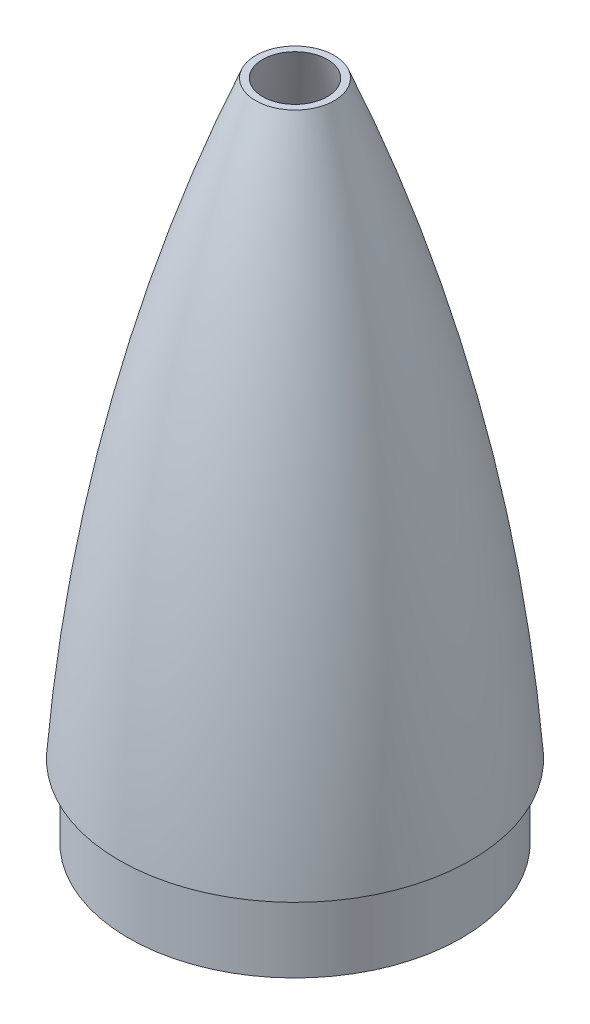
ISO-10303-21;
HEADER;
FILE_DESCRIPTION(('STEP AP214'),'2;1');
FILE_NAME('part.step','',(''),(''),'','','');
FILE_SCHEMA(('AUTOMOTIVE_DESIGN { 1 0 10303 214 1 1 1 1 }'));
ENDSEC;
DATA;
#1=APPLICATION_CONTEXT('core data for automotive mechanical design processes');
#2=APPLICATION_PROTOCOL_DEFINITION('international standard','automotive_design',2000,#1);
#3=PRODUCT_CONTEXT('',#1,'mechanical');
#4=PRODUCT('Part','Part','',(#3));
#5=PRODUCT_RELATED_PRODUCT_CATEGORY('part','',(#4));
#6=PRODUCT_DEFINITION_FORMATION('','',#4);
#7=PRODUCT_DEFINITION_CONTEXT('part definition',#1,'design');
#8=PRODUCT_DEFINITION('design','',#6,#7);
#9=PRODUCT_DEFINITION_SHAPE('','',#8);
#10=(LENGTH_UNIT() NAMED_UNIT(*) SI_UNIT(.MILLI.,.METRE.));
#11=(NAMED_UNIT(*) PLANE_ANGLE_UNIT() SI_UNIT($,.RADIAN.));
#12=(NAMED_UNIT(*) SI_UNIT($,.STERADIAN.) SOLID_ANGLE_UNIT());
#13=UNCERTAINTY_MEASURE_WITH_UNIT(LENGTH_MEASURE(1.E-05),#10,'distance_accuracy_value','');
#14=(GEOMETRIC_REPRESENTATION_CONTEXT(3) GLOBAL_UNCERTAINTY_ASSIGNED_CONTEXT((#13)) GLOBAL_UNIT_ASSIGNED_CONTEXT((#10,
#11,#12)) REPRESENTATION_CONTEXT('',''));
#15=CARTESIAN_POINT('',(0.,0.,0.));
#16=DIRECTION('',(0.,0.,1.));
#17=DIRECTION('',(1.,0.,0.));
#18=AXIS2_PLACEMENT_3D('',#15,#16,#17);
#19=CARTESIAN_POINT('',(-7.7715611723761E-13,-78.5092148022549,0.));
#20=DIRECTION('',(0.,1.,0.));
#21=DIRECTION('',(-1.,0.,0.));
#22=AXIS2_PLACEMENT_3D('',#19,#20,#21);
#23=DEGENERATE_TOROIDAL_SURFACE('',#22,992.11349278293,1093.36082838655,.F.);
#24=CARTESIAN_POINT('',(-6.53226602665202E-13,-1.66533453693773E-13,0.));
#25=DIRECTION('',(0.,1.,0.));
#26=DIRECTION('',(-1.,0.,0.));
#27=AXIS2_PLACEMENT_3D('',#24,#25,#26);
#28=CIRCLE('',#27,98.4249999999993);
#29=CARTESIAN_POINT('',(-98.425,0.,0.));
#30=VERTEX_POINT('',#29);
#31=EDGE_CURVE('E10',#30,#30,#28,.T.);
#32=ORIENTED_EDGE('',*,*,#31,.T.);
#33=EDGE_LOOP('',(#32));
#34=FACE_BOUND('',#33,.T.);
#35=CARTESIAN_POINT('',(-7.7715611723761E-13,330.2,0.));
#36=DIRECTION('',(0.,1.,0.));
#37=DIRECTION('',(0.,0.,1.));
#38=AXIS2_PLACEMENT_3D('',#35,#36,#37);
#39=CIRCLE('',#38,21.9844703280578);
#40=CARTESIAN_POINT('',(-7.7715611723761E-13,330.2,21.9844703280578));
#41=VERTEX_POINT('',#40);
#42=EDGE_CURVE('E57',#41,#41,#39,.F.);
#43=ORIENTED_EDGE('',*,*,#42,.T.);
#44=EDGE_LOOP('',(#43));
#45=FACE_BOUND('',#44,.T.);
#46=ADVANCED_FACE('F34',(#34,#45),#23,.F.);
#47=CARTESIAN_POINT('',(-8.88178419700125E-13,-90.9690996932709,0.));
#48=DIRECTION('',(0.,1.,0.));
#49=DIRECTION('',(-1.,0.,0.));
#50=AXIS2_PLACEMENT_3D('',#47,#48,#49);
#51=DEGENERATE_TOROIDAL_SURFACE('',#50,1112.69102888091,1206.67591223346,.F.);
#52=CARTESIAN_POINT('',(-6.53226602665202E-13,0.,0.));
#53=DIRECTION('',(0.,1.,0.));
#54=DIRECTION('',(-1.,0.,0.));
#55=AXIS2_PLACEMENT_3D('',#52,#53,#54);
#56=CIRCLE('',#55,90.5509999999994);
#57=CARTESIAN_POINT('',(-90.551,0.,0.));
#58=VERTEX_POINT('',#57);
#59=EDGE_CURVE('E41',#58,#58,#56,.T.);
#60=ORIENTED_EDGE('',*,*,#59,.F.);
#61=EDGE_LOOP('',(#60));
#62=FACE_BOUND('',#61,.T.);
#63=CARTESIAN_POINT('',(-8.88178419700125E-13,330.2,0.));
#64=DIRECTION('',(0.,1.,0.));
#65=DIRECTION('',(0.,0.,1.));
#66=AXIS2_PLACEMENT_3D('',#63,#64,#65);
#67=CIRCLE('',#66,18.0977872240295);
#68=CARTESIAN_POINT('',(-8.88178419700125E-13,330.2,18.0977872240295));
#69=VERTEX_POINT('',#68);
#70=EDGE_CURVE('E37',#69,#69,#67,.T.);
#71=ORIENTED_EDGE('',*,*,#70,.T.);
#72=EDGE_LOOP('',(#71));
#73=FACE_BOUND('',#72,.T.);
#74=ADVANCED_FACE('F66',(#62,#73),#51,.T.);
#75=CARTESIAN_POINT('',(-98.425,0.,0.));
#76=DIRECTION('',(0.,-1.,0.));
#77=DIRECTION('',(1.,0.,0.));
#78=AXIS2_PLACEMENT_3D('',#75,#76,#77);
#79=PLANE('',#78);
#80=CARTESIAN_POINT('',(0.,0.,0.));
#81=DIRECTION('',(0.,-1.,0.));
#82=DIRECTION('',(1.,0.,0.));
#83=AXIS2_PLACEMENT_3D('',#80,#81,#82);
#84=CIRCLE('',#83,93.1545);
#85=CARTESIAN_POINT('',(93.1545,-1.59713904351642E-13,0.));
#86=VERTEX_POINT('',#85);
#87=EDGE_CURVE('E48',#86,#86,#84,.T.);
#88=ORIENTED_EDGE('',*,*,#87,.F.);
#89=EDGE_LOOP('',(#88));
#90=FACE_BOUND('',#89,.T.);
#91=ORIENTED_EDGE('',*,*,#31,.F.);
#92=EDGE_LOOP('',(#91));
#93=FACE_BOUND('',#92,.T.);
#94=ADVANCED_FACE('F83',(#90,#93),#79,.T.);
#95=CARTESIAN_POINT('',(0.,0.,0.));
#96=DIRECTION('',(0.,-1.,0.));
#97=DIRECTION('',(1.,0.,0.));
#98=AXIS2_PLACEMENT_3D('',#95,#96,#97);
#99=PLANE('',#98);
#100=CARTESIAN_POINT('',(0.,0.,0.));
#101=DIRECTION('',(0.,-1.,0.));
#102=DIRECTION('',(1.,0.,0.));
#103=AXIS2_PLACEMENT_3D('',#100,#101,#102);
#104=CIRCLE('',#103,90.4875);
#105=CARTESIAN_POINT('',(90.4875,-1.55141318132985E-13,0.));
#106=VERTEX_POINT('',#105);
#107=EDGE_CURVE('E54',#106,#106,#104,.T.);
#108=ORIENTED_EDGE('',*,*,#107,.T.);
#109=EDGE_LOOP('',(#108));
#110=FACE_BOUND('',#109,.T.);
#111=ORIENTED_EDGE('',*,*,#59,.T.);
#112=EDGE_LOOP('',(#111));
#113=FACE_BOUND('',#112,.T.);
#114=ADVANCED_FACE('F89',(#110,#113),#99,.F.);
#115=CARTESIAN_POINT('',(0.,-40.3999954,0.));
#116=DIRECTION('',(0.,-1.,0.));
#117=DIRECTION('',(1.,0.,0.));
#118=AXIS2_PLACEMENT_3D('',#115,#116,#117);
#119=PLANE('',#118);
#120=CARTESIAN_POINT('',(0.,-40.3999954,0.));
#121=DIRECTION('',(0.,-1.,0.));
#122=DIRECTION('',(1.,0.,0.));
#123=AXIS2_PLACEMENT_3D('',#120,#121,#122);
#124=CIRCLE('',#123,93.1545);
#125=CARTESIAN_POINT('',(93.1544999999999,-40.3999954000002,0.));
#126=VERTEX_POINT('',#125);
#127=EDGE_CURVE('E45',#126,#126,#124,.T.);
#128=ORIENTED_EDGE('',*,*,#127,.T.);
#129=EDGE_LOOP('',(#128));
#130=FACE_BOUND('',#129,.T.);
#131=CARTESIAN_POINT('',(0.,-40.3999954,0.));
#132=DIRECTION('',(0.,-1.,0.));
#133=DIRECTION('',(1.,0.,0.));
#134=AXIS2_PLACEMENT_3D('',#131,#132,#133);
#135=CIRCLE('',#134,90.4875);
#136=CARTESIAN_POINT('',(90.4874999999999,-40.3999954000002,0.));
#137=VERTEX_POINT('',#136);
#138=EDGE_CURVE('E51',#137,#137,#135,.T.);
#139=ORIENTED_EDGE('',*,*,#138,.F.);
#140=EDGE_LOOP('',(#139));
#141=FACE_BOUND('',#140,.T.);
#142=ADVANCED_FACE('F95',(#130,#141),#119,.T.);
#143=CARTESIAN_POINT('',(0.,-40.3999954,0.));
#144=DIRECTION('',(0.,1.,0.));
#145=DIRECTION('',(-1.,0.,0.));
#146=AXIS2_PLACEMENT_3D('',#143,#144,#145);
#147=CYLINDRICAL_SURFACE('',#146,93.1545);
#148=ORIENTED_EDGE('',*,*,#127,.F.);
#149=EDGE_LOOP('',(#148));
#150=FACE_BOUND('',#149,.T.);
#151=ORIENTED_EDGE('',*,*,#87,.T.);
#152=EDGE_LOOP('',(#151));
#153=FACE_BOUND('',#152,.T.);
#154=ADVANCED_FACE('F76',(#150,#153),#147,.T.);
#155=CARTESIAN_POINT('',(0.,-40.3999954,0.));
#156=DIRECTION('',(0.,1.,0.));
#157=DIRECTION('',(-1.,0.,0.));
#158=AXIS2_PLACEMENT_3D('',#155,#156,#157);
#159=CYLINDRICAL_SURFACE('',#158,90.4875);
#160=ORIENTED_EDGE('',*,*,#138,.T.);
#161=EDGE_LOOP('',(#160));
#162=FACE_BOUND('',#161,.T.);
#163=ORIENTED_EDGE('',*,*,#107,.F.);
#164=EDGE_LOOP('',(#163));
#165=FACE_BOUND('',#164,.T.);
#166=ADVANCED_FACE('F70',(#162,#165),#159,.F.);
#167=CARTESIAN_POINT('',(0.,330.2,0.));
#168=DIRECTION('',(0.,1.,0.));
#169=DIRECTION('',(0.,0.,1.));
#170=AXIS2_PLACEMENT_3D('',#167,#168,#169);
#171=PLANE('',#170);
#172=ORIENTED_EDGE('',*,*,#42,.F.);
#173=EDGE_LOOP('',(#172));
#174=FACE_BOUND('',#173,.T.);
#175=ORIENTED_EDGE('',*,*,#70,.F.);
#176=EDGE_LOOP('',(#175));
#177=FACE_BOUND('',#176,.T.);
#178=ADVANCED_FACE('F68',(#174,#177),#171,.T.);
#179=CLOSED_SHELL('',(#46,#74,#94,#114,#142,#154,#166,#178));
#180=MANIFOLD_SOLID_BREP('B2',#179);
#181=ADVANCED_BREP_SHAPE_REPRESENTATION('',(#18,#180),#14);
#182=SHAPE_DEFINITION_REPRESENTATION(#9,#181);
ENDSEC;
END-ISO-10303-21;
